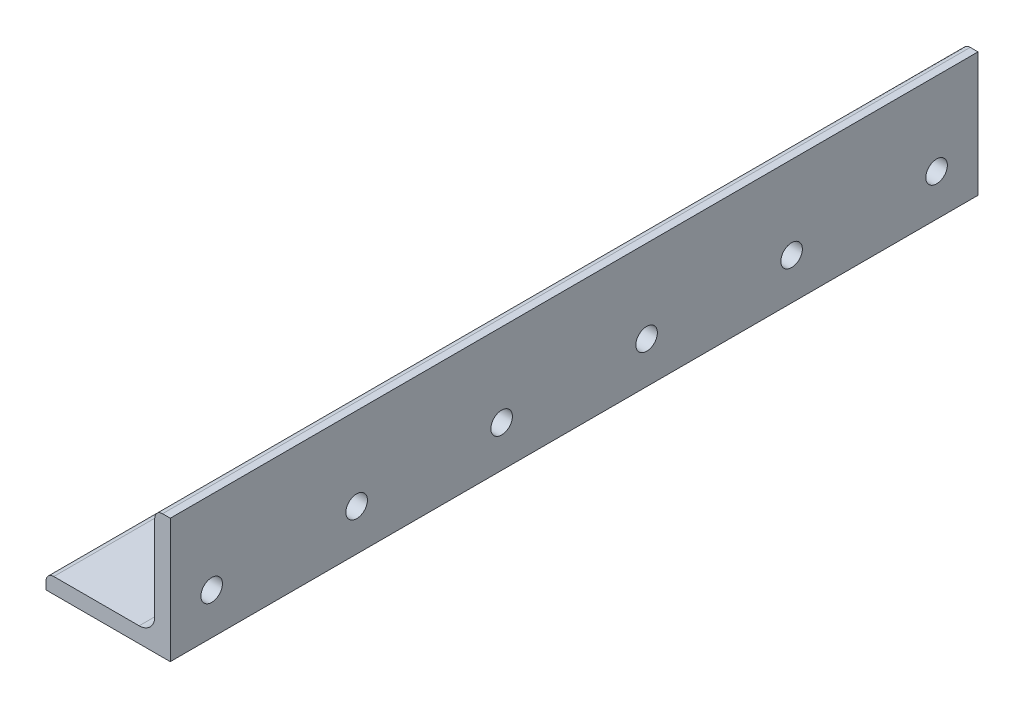
ISO-10303-21;
HEADER;
FILE_DESCRIPTION(('STEP AP214'),'2;1');
FILE_NAME('part.step','',(''),(''),'','','');
FILE_SCHEMA(('AUTOMOTIVE_DESIGN { 1 0 10303 214 1 1 1 1 }'));
ENDSEC;
DATA;
#1=APPLICATION_CONTEXT('core data for automotive mechanical design processes');
#2=APPLICATION_PROTOCOL_DEFINITION('international standard','automotive_design',2000,#1);
#3=PRODUCT_CONTEXT('',#1,'mechanical');
#4=PRODUCT('Part','Part','',(#3));
#5=PRODUCT_RELATED_PRODUCT_CATEGORY('part','',(#4));
#6=PRODUCT_DEFINITION_FORMATION('','',#4);
#7=PRODUCT_DEFINITION_CONTEXT('part definition',#1,'design');
#8=PRODUCT_DEFINITION('design','',#6,#7);
#9=PRODUCT_DEFINITION_SHAPE('','',#8);
#10=(LENGTH_UNIT() NAMED_UNIT(*) SI_UNIT(.MILLI.,.METRE.));
#11=(NAMED_UNIT(*) PLANE_ANGLE_UNIT() SI_UNIT($,.RADIAN.));
#12=(NAMED_UNIT(*) SI_UNIT($,.STERADIAN.) SOLID_ANGLE_UNIT());
#13=UNCERTAINTY_MEASURE_WITH_UNIT(LENGTH_MEASURE(1.E-05),#10,'distance_accuracy_value','');
#14=(GEOMETRIC_REPRESENTATION_CONTEXT(3) GLOBAL_UNCERTAINTY_ASSIGNED_CONTEXT((#13)) GLOBAL_UNIT_ASSIGNED_CONTEXT((#10,
#11,#12)) REPRESENTATION_CONTEXT('',''));
#15=CARTESIAN_POINT('',(0.,0.,0.));
#16=DIRECTION('',(0.,0.,1.));
#17=DIRECTION('',(1.,0.,0.));
#18=AXIS2_PLACEMENT_3D('',#15,#16,#17);
#19=CARTESIAN_POINT('',(-19.05,-16.66875,123.825));
#20=DIRECTION('',(1.,0.,0.));
#21=DIRECTION('',(0.,0.,-1.));
#22=AXIS2_PLACEMENT_3D('',#19,#20,#21);
#23=PLANE('',#22);
#24=DIRECTION('',(0.,-1.,0.));
#25=VECTOR('',#24,1.);
#26=CARTESIAN_POINT('',(-19.05,-16.66875,-123.825));
#27=LINE('',#26,#25);
#28=CARTESIAN_POINT('',(-19.05,-16.66875,-123.825));
#29=VERTEX_POINT('',#28);
#30=CARTESIAN_POINT('',(-19.05,-19.05,-123.825));
#31=VERTEX_POINT('',#30);
#32=EDGE_CURVE('E149',#29,#31,#27,.T.);
#33=ORIENTED_EDGE('',*,*,#32,.T.);
#34=DIRECTION('',(0.,0.,-1.));
#35=VECTOR('',#34,1.);
#36=CARTESIAN_POINT('',(-19.05,-19.05,123.825));
#37=LINE('',#36,#35);
#38=CARTESIAN_POINT('',(-19.05,-19.05,123.825));
#39=VERTEX_POINT('',#38);
#40=EDGE_CURVE('E11',#39,#31,#37,.T.);
#41=ORIENTED_EDGE('',*,*,#40,.F.);
#42=DIRECTION('',(0.,-1.,0.));
#43=VECTOR('',#42,1.);
#44=CARTESIAN_POINT('',(-19.05,-16.66875,123.825));
#45=LINE('',#44,#43);
#46=CARTESIAN_POINT('',(-19.05,-16.66875,123.825));
#47=VERTEX_POINT('',#46);
#48=EDGE_CURVE('E204',#47,#39,#45,.T.);
#49=ORIENTED_EDGE('',*,*,#48,.F.);
#50=DIRECTION('',(0.,0.,-1.));
#51=VECTOR('',#50,1.);
#52=CARTESIAN_POINT('',(-19.05,-16.66875,123.825));
#53=LINE('',#52,#51);
#54=EDGE_CURVE('E205',#47,#29,#53,.T.);
#55=ORIENTED_EDGE('',*,*,#54,.T.);
#56=EDGE_LOOP('',(#33,#41,#49,#55));
#57=FACE_BOUND('',#56,.T.);
#58=ADVANCED_FACE('F33',(#57),#23,.F.);
#59=CARTESIAN_POINT('',(-19.05,-19.05,123.825));
#60=DIRECTION('',(0.,1.,0.));
#61=DIRECTION('',(-1.,0.,0.));
#62=AXIS2_PLACEMENT_3D('',#59,#60,#61);
#63=PLANE('',#62);
#64=CARTESIAN_POINT('',(4.25007251614318E-13,-19.05,-92.075));
#65=DIRECTION('',(0.,-1.,0.));
#66=DIRECTION('',(1.,0.,0.));
#67=AXIS2_PLACEMENT_3D('',#64,#65,#66);
#68=CIRCLE('',#67,3.30199999999999);
#69=CARTESIAN_POINT('',(3.30200000000042,-19.05,-92.075));
#70=VERTEX_POINT('',#69);
#71=EDGE_CURVE('E379',#70,#70,#68,.T.);
#72=ORIENTED_EDGE('',*,*,#71,.F.);
#73=EDGE_LOOP('',(#72));
#74=FACE_BOUND('',#73,.T.);
#75=CARTESIAN_POINT('',(2.68176267385261E-13,-19.05,-46.355));
#76=DIRECTION('',(0.,-1.,0.));
#77=DIRECTION('',(1.,0.,0.));
#78=AXIS2_PLACEMENT_3D('',#75,#76,#77);
#79=CIRCLE('',#78,3.302);
#80=CARTESIAN_POINT('',(3.30200000000027,-19.05,-46.355));
#81=VERTEX_POINT('',#80);
#82=EDGE_CURVE('E373',#81,#81,#79,.T.);
#83=ORIENTED_EDGE('',*,*,#82,.F.);
#84=EDGE_LOOP('',(#83));
#85=FACE_BOUND('',#84,.T.);
#86=CARTESIAN_POINT('',(1.11345283156203E-13,-19.05,-0.634999999999997));
#87=DIRECTION('',(0.,-1.,0.));
#88=DIRECTION('',(1.,0.,0.));
#89=AXIS2_PLACEMENT_3D('',#86,#87,#88);
#90=CIRCLE('',#89,3.302);
#91=CARTESIAN_POINT('',(3.30200000000011,-19.05,-0.634999999999997));
#92=VERTEX_POINT('',#91);
#93=EDGE_CURVE('E367',#92,#92,#90,.T.);
#94=ORIENTED_EDGE('',*,*,#93,.F.);
#95=EDGE_LOOP('',(#94));
#96=FACE_BOUND('',#95,.T.);
#97=CARTESIAN_POINT('',(0.,-19.05,45.085));
#98=DIRECTION('',(0.,-1.,0.));
#99=DIRECTION('',(1.,0.,0.));
#100=AXIS2_PLACEMENT_3D('',#97,#98,#99);
#101=CIRCLE('',#100,3.30199999999999);
#102=CARTESIAN_POINT('',(3.30199999999994,-19.05,45.085));
#103=VERTEX_POINT('',#102);
#104=EDGE_CURVE('E360',#103,#103,#101,.T.);
#105=ORIENTED_EDGE('',*,*,#104,.F.);
#106=EDGE_LOOP('',(#105));
#107=FACE_BOUND('',#106,.T.);
#108=CARTESIAN_POINT('',(-2.02316685301911E-13,-19.05,90.805));
#109=DIRECTION('',(0.,-1.,0.));
#110=DIRECTION('',(1.,0.,0.));
#111=AXIS2_PLACEMENT_3D('',#108,#109,#110);
#112=CIRCLE('',#111,3.30199999999999);
#113=CARTESIAN_POINT('',(3.30199999999979,-19.05,90.805));
#114=VERTEX_POINT('',#113);
#115=EDGE_CURVE('E361',#114,#114,#112,.T.);
#116=ORIENTED_EDGE('',*,*,#115,.F.);
#117=EDGE_LOOP('',(#116));
#118=FACE_BOUND('',#117,.T.);
#119=DIRECTION('',(1.,0.,0.));
#120=VECTOR('',#119,1.);
#121=CARTESIAN_POINT('',(-19.05,-19.05,-123.825));
#122=LINE('',#121,#120);
#123=CARTESIAN_POINT('',(19.05,-19.05,-123.825));
#124=VERTEX_POINT('',#123);
#125=EDGE_CURVE('E186',#31,#124,#122,.T.);
#126=ORIENTED_EDGE('',*,*,#125,.T.);
#127=DIRECTION('',(0.,0.,-1.));
#128=VECTOR('',#127,1.);
#129=CARTESIAN_POINT('',(19.05,-19.05,123.825));
#130=LINE('',#129,#128);
#131=CARTESIAN_POINT('',(19.05,-19.05,123.825));
#132=VERTEX_POINT('',#131);
#133=EDGE_CURVE('E40',#132,#124,#130,.T.);
#134=ORIENTED_EDGE('',*,*,#133,.F.);
#135=DIRECTION('',(1.,0.,0.));
#136=VECTOR('',#135,1.);
#137=CARTESIAN_POINT('',(-19.05,-19.05,123.825));
#138=LINE('',#137,#136);
#139=EDGE_CURVE('E232',#39,#132,#138,.T.);
#140=ORIENTED_EDGE('',*,*,#139,.F.);
#141=ORIENTED_EDGE('',*,*,#40,.T.);
#142=EDGE_LOOP('',(#126,#134,#140,#141));
#143=FACE_BOUND('',#142,.T.);
#144=ADVANCED_FACE('F390',(#74,#85,#96,#107,#118,#143),#63,.F.);
#145=CARTESIAN_POINT('',(19.05,-19.05,123.825));
#146=DIRECTION('',(-1.,0.,0.));
#147=DIRECTION('',(0.,-1.,0.));
#148=AXIS2_PLACEMENT_3D('',#145,#146,#147);
#149=PLANE('',#148);
#150=CARTESIAN_POINT('',(19.05,-6.34999999999978,-111.125));
#151=DIRECTION('',(1.,0.,0.));
#152=DIRECTION('',(0.,1.,0.));
#153=AXIS2_PLACEMENT_3D('',#150,#151,#152);
#154=CIRCLE('',#153,3.302);
#155=CARTESIAN_POINT('',(19.05,-3.04799999999979,-111.125));
#156=VERTEX_POINT('',#155);
#157=EDGE_CURVE('E141',#156,#156,#154,.T.);
#158=ORIENTED_EDGE('',*,*,#157,.F.);
#159=EDGE_LOOP('',(#158));
#160=FACE_BOUND('',#159,.T.);
#161=CARTESIAN_POINT('',(19.05,-6.34999999999978,-66.6750000000001));
#162=DIRECTION('',(1.,0.,0.));
#163=DIRECTION('',(0.,1.,0.));
#164=AXIS2_PLACEMENT_3D('',#161,#162,#163);
#165=CIRCLE('',#164,3.302);
#166=CARTESIAN_POINT('',(19.05,-3.04799999999979,-66.6750000000001));
#167=VERTEX_POINT('',#166);
#168=EDGE_CURVE('E339',#167,#167,#165,.T.);
#169=ORIENTED_EDGE('',*,*,#168,.F.);
#170=EDGE_LOOP('',(#169));
#171=FACE_BOUND('',#170,.T.);
#172=CARTESIAN_POINT('',(19.05,-6.34999999999978,-22.2250000000002));
#173=DIRECTION('',(1.,0.,0.));
#174=DIRECTION('',(0.,1.,0.));
#175=AXIS2_PLACEMENT_3D('',#172,#173,#174);
#176=CIRCLE('',#175,3.302);
#177=CARTESIAN_POINT('',(19.05,-3.04799999999979,-22.2250000000002));
#178=VERTEX_POINT('',#177);
#179=EDGE_CURVE('E329',#178,#178,#176,.T.);
#180=ORIENTED_EDGE('',*,*,#179,.F.);
#181=EDGE_LOOP('',(#180));
#182=FACE_BOUND('',#181,.T.);
#183=CARTESIAN_POINT('',(19.05,-6.34999999999978,22.2249999999999));
#184=DIRECTION('',(1.,0.,0.));
#185=DIRECTION('',(0.,1.,0.));
#186=AXIS2_PLACEMENT_3D('',#183,#184,#185);
#187=CIRCLE('',#186,3.302);
#188=CARTESIAN_POINT('',(19.05,-3.04799999999979,22.2249999999999));
#189=VERTEX_POINT('',#188);
#190=EDGE_CURVE('E294',#189,#189,#187,.T.);
#191=ORIENTED_EDGE('',*,*,#190,.F.);
#192=EDGE_LOOP('',(#191));
#193=FACE_BOUND('',#192,.T.);
#194=CARTESIAN_POINT('',(19.05,-6.34999999999978,66.6749999999999));
#195=DIRECTION('',(1.,0.,0.));
#196=DIRECTION('',(0.,1.,0.));
#197=AXIS2_PLACEMENT_3D('',#194,#195,#196);
#198=CIRCLE('',#197,3.30199999999998);
#199=CARTESIAN_POINT('',(19.05,-3.0479999999998,66.6749999999999));
#200=VERTEX_POINT('',#199);
#201=EDGE_CURVE('E259',#200,#200,#198,.T.);
#202=ORIENTED_EDGE('',*,*,#201,.F.);
#203=EDGE_LOOP('',(#202));
#204=FACE_BOUND('',#203,.T.);
#205=CARTESIAN_POINT('',(19.05,-6.34999999999978,111.125));
#206=DIRECTION('',(1.,0.,0.));
#207=DIRECTION('',(0.,1.,0.));
#208=AXIS2_PLACEMENT_3D('',#205,#206,#207);
#209=CIRCLE('',#208,3.302);
#210=CARTESIAN_POINT('',(19.05,-3.04799999999979,111.125));
#211=VERTEX_POINT('',#210);
#212=EDGE_CURVE('E263',#211,#211,#209,.T.);
#213=ORIENTED_EDGE('',*,*,#212,.F.);
#214=EDGE_LOOP('',(#213));
#215=FACE_BOUND('',#214,.T.);
#216=DIRECTION('',(0.,1.,0.));
#217=VECTOR('',#216,1.);
#218=CARTESIAN_POINT('',(19.05,-19.05,-123.825));
#219=LINE('',#218,#217);
#220=CARTESIAN_POINT('',(19.05,19.05,-123.825));
#221=VERTEX_POINT('',#220);
#222=EDGE_CURVE('E179',#124,#221,#219,.T.);
#223=ORIENTED_EDGE('',*,*,#222,.T.);
#224=DIRECTION('',(0.,0.,-1.));
#225=VECTOR('',#224,1.);
#226=CARTESIAN_POINT('',(19.05,19.05,123.825));
#227=LINE('',#226,#225);
#228=CARTESIAN_POINT('',(19.05,19.05,123.825));
#229=VERTEX_POINT('',#228);
#230=EDGE_CURVE('E170',#229,#221,#227,.T.);
#231=ORIENTED_EDGE('',*,*,#230,.F.);
#232=DIRECTION('',(0.,1.,0.));
#233=VECTOR('',#232,1.);
#234=CARTESIAN_POINT('',(19.05,-19.05,123.825));
#235=LINE('',#234,#233);
#236=EDGE_CURVE('E180',#132,#229,#235,.T.);
#237=ORIENTED_EDGE('',*,*,#236,.F.);
#238=ORIENTED_EDGE('',*,*,#133,.T.);
#239=EDGE_LOOP('',(#223,#231,#237,#238));
#240=FACE_BOUND('',#239,.T.);
#241=ADVANCED_FACE('F177',(#160,#171,#182,#193,#204,#215,#240),#149,.F.);
#242=CARTESIAN_POINT('',(16.66875,19.05,123.825));
#243=DIRECTION('',(0.,-1.,0.));
#244=DIRECTION('',(1.,0.,0.));
#245=AXIS2_PLACEMENT_3D('',#242,#243,#244);
#246=PLANE('',#245);
#247=DIRECTION('',(-1.,0.,0.));
#248=VECTOR('',#247,1.);
#249=CARTESIAN_POINT('',(16.66875,19.05,-123.825));
#250=LINE('',#249,#248);
#251=CARTESIAN_POINT('',(16.66875,19.05,-123.825));
#252=VERTEX_POINT('',#251);
#253=EDGE_CURVE('E188',#221,#252,#250,.T.);
#254=ORIENTED_EDGE('',*,*,#253,.T.);
#255=DIRECTION('',(0.,0.,-1.));
#256=VECTOR('',#255,1.);
#257=CARTESIAN_POINT('',(16.66875,19.05,123.825));
#258=LINE('',#257,#256);
#259=CARTESIAN_POINT('',(16.66875,19.05,123.825));
#260=VERTEX_POINT('',#259);
#261=EDGE_CURVE('E167',#260,#252,#258,.T.);
#262=ORIENTED_EDGE('',*,*,#261,.F.);
#263=DIRECTION('',(-1.,0.,0.));
#264=VECTOR('',#263,1.);
#265=CARTESIAN_POINT('',(16.66875,19.05,123.825));
#266=LINE('',#265,#264);
#267=EDGE_CURVE('E240',#229,#260,#266,.T.);
#268=ORIENTED_EDGE('',*,*,#267,.F.);
#269=ORIENTED_EDGE('',*,*,#230,.T.);
#270=EDGE_LOOP('',(#254,#262,#268,#269));
#271=FACE_BOUND('',#270,.T.);
#272=ADVANCED_FACE('F403',(#271),#246,.F.);
#273=CARTESIAN_POINT('',(16.66875,16.66875,123.825));
#274=DIRECTION('',(0.,0.,-1.));
#275=DIRECTION('',(-1.,0.,0.));
#276=AXIS2_PLACEMENT_3D('',#273,#274,#275);
#277=CYLINDRICAL_SURFACE('',#276,2.38125);
#278=CARTESIAN_POINT('',(16.66875,16.66875,-123.825));
#279=DIRECTION('',(0.,0.,1.));
#280=DIRECTION('',(-1.,0.,0.));
#281=AXIS2_PLACEMENT_3D('',#278,#279,#280);
#282=CIRCLE('',#281,2.38125);
#283=CARTESIAN_POINT('',(14.2875,16.66875,-123.825));
#284=VERTEX_POINT('',#283);
#285=EDGE_CURVE('E190',#252,#284,#282,.T.);
#286=ORIENTED_EDGE('',*,*,#285,.T.);
#287=DIRECTION('',(0.,0.,-1.));
#288=VECTOR('',#287,1.);
#289=CARTESIAN_POINT('',(14.2875,16.66875,123.825));
#290=LINE('',#289,#288);
#291=CARTESIAN_POINT('',(14.2875,16.66875,123.825));
#292=VERTEX_POINT('',#291);
#293=EDGE_CURVE('E162',#292,#284,#290,.T.);
#294=ORIENTED_EDGE('',*,*,#293,.F.);
#295=CARTESIAN_POINT('',(16.66875,16.66875,123.825));
#296=DIRECTION('',(0.,0.,1.));
#297=DIRECTION('',(-1.,0.,0.));
#298=AXIS2_PLACEMENT_3D('',#295,#296,#297);
#299=CIRCLE('',#298,2.38125);
#300=EDGE_CURVE('E242',#260,#292,#299,.T.);
#301=ORIENTED_EDGE('',*,*,#300,.F.);
#302=ORIENTED_EDGE('',*,*,#261,.T.);
#303=EDGE_LOOP('',(#286,#294,#301,#302));
#304=FACE_BOUND('',#303,.T.);
#305=ADVANCED_FACE('F407',(#304),#277,.T.);
#306=CARTESIAN_POINT('',(14.2875,16.66875,123.825));
#307=DIRECTION('',(1.,0.,0.));
#308=DIRECTION('',(0.,1.,0.));
#309=AXIS2_PLACEMENT_3D('',#306,#307,#308);
#310=PLANE('',#309);
#311=DIRECTION('',(0.,0.,-1.));
#312=VECTOR('',#311,1.);
#313=CARTESIAN_POINT('',(14.2875,-9.5123,123.825));
#314=LINE('',#313,#312);
#315=CARTESIAN_POINT('',(14.2875,-9.5123,-112.075296117007));
#316=VERTEX_POINT('',#315);
#317=CARTESIAN_POINT('',(14.2875,-9.5123,-123.825));
#318=VERTEX_POINT('',#317);
#319=EDGE_CURVE('E148',#316,#318,#314,.T.);
#320=ORIENTED_EDGE('',*,*,#319,.F.);
#321=CARTESIAN_POINT('',(14.2875,-6.34999999999978,-111.125));
#322=DIRECTION('',(1.,0.,0.));
#323=DIRECTION('',(0.,1.,0.));
#324=AXIS2_PLACEMENT_3D('',#321,#322,#323);
#325=CIRCLE('',#324,3.302);
#326=CARTESIAN_POINT('',(14.2875,-9.5123,-110.174703882993));
#327=VERTEX_POINT('',#326);
#328=EDGE_CURVE('E46',#327,#316,#325,.F.);
#329=ORIENTED_EDGE('',*,*,#328,.F.);
#330=CARTESIAN_POINT('',(14.2875,-9.5123,-67.6252961170072));
#331=VERTEX_POINT('',#330);
#332=EDGE_CURVE('E146',#331,#327,#314,.T.);
#333=ORIENTED_EDGE('',*,*,#332,.F.);
#334=CARTESIAN_POINT('',(14.2875,-6.34999999999978,-66.6750000000001));
#335=DIRECTION('',(1.,0.,0.));
#336=DIRECTION('',(0.,1.,0.));
#337=AXIS2_PLACEMENT_3D('',#334,#335,#336);
#338=CIRCLE('',#337,3.302);
#339=CARTESIAN_POINT('',(14.2875,-9.5123,-65.7247038829931));
#340=VERTEX_POINT('',#339);
#341=EDGE_CURVE('E53',#340,#331,#338,.F.);
#342=ORIENTED_EDGE('',*,*,#341,.F.);
#343=CARTESIAN_POINT('',(14.2875,-9.5123,-23.1752961170072));
#344=VERTEX_POINT('',#343);
#345=EDGE_CURVE('E154',#344,#340,#314,.T.);
#346=ORIENTED_EDGE('',*,*,#345,.F.);
#347=CARTESIAN_POINT('',(14.2875,-6.34999999999978,-22.2250000000002));
#348=DIRECTION('',(1.,0.,0.));
#349=DIRECTION('',(0.,1.,0.));
#350=AXIS2_PLACEMENT_3D('',#347,#348,#349);
#351=CIRCLE('',#350,3.302);
#352=CARTESIAN_POINT('',(14.2875,-9.5123,-21.2747038829931));
#353=VERTEX_POINT('',#352);
#354=EDGE_CURVE('E305',#353,#344,#351,.F.);
#355=ORIENTED_EDGE('',*,*,#354,.F.);
#356=CARTESIAN_POINT('',(14.2875,-9.5123,21.2747038829929));
#357=VERTEX_POINT('',#356);
#358=EDGE_CURVE('E156',#357,#353,#314,.T.);
#359=ORIENTED_EDGE('',*,*,#358,.F.);
#360=CARTESIAN_POINT('',(14.2875,-6.34999999999978,22.2249999999999));
#361=DIRECTION('',(1.,0.,0.));
#362=DIRECTION('',(0.,1.,0.));
#363=AXIS2_PLACEMENT_3D('',#360,#361,#362);
#364=CIRCLE('',#363,3.302);
#365=CARTESIAN_POINT('',(14.2875,-9.5123,23.1752961170069));
#366=VERTEX_POINT('',#365);
#367=EDGE_CURVE('E302',#366,#357,#364,.F.);
#368=ORIENTED_EDGE('',*,*,#367,.F.);
#369=CARTESIAN_POINT('',(14.2875,-9.5123,65.7247038829929));
#370=VERTEX_POINT('',#369);
#371=EDGE_CURVE('E602',#370,#366,#314,.T.);
#372=ORIENTED_EDGE('',*,*,#371,.F.);
#373=CARTESIAN_POINT('',(14.2875,-6.34999999999978,66.6749999999999));
#374=DIRECTION('',(1.,0.,0.));
#375=DIRECTION('',(0.,1.,0.));
#376=AXIS2_PLACEMENT_3D('',#373,#374,#375);
#377=CIRCLE('',#376,3.30199999999998);
#378=CARTESIAN_POINT('',(14.2875,-9.5123,67.6252961170068));
#379=VERTEX_POINT('',#378);
#380=EDGE_CURVE('E292',#379,#370,#377,.F.);
#381=ORIENTED_EDGE('',*,*,#380,.F.);
#382=CARTESIAN_POINT('',(14.2875,-9.5123,110.174703882993));
#383=VERTEX_POINT('',#382);
#384=EDGE_CURVE('E163',#383,#379,#314,.T.);
#385=ORIENTED_EDGE('',*,*,#384,.F.);
#386=CARTESIAN_POINT('',(14.2875,-6.34999999999978,111.125));
#387=DIRECTION('',(1.,0.,0.));
#388=DIRECTION('',(0.,1.,0.));
#389=AXIS2_PLACEMENT_3D('',#386,#387,#388);
#390=CIRCLE('',#389,3.302);
#391=CARTESIAN_POINT('',(14.2875,-9.5123,112.075296117007));
#392=VERTEX_POINT('',#391);
#393=EDGE_CURVE('E236',#392,#383,#390,.F.);
#394=ORIENTED_EDGE('',*,*,#393,.F.);
#395=CARTESIAN_POINT('',(14.2875,-9.5123,123.825));
#396=VERTEX_POINT('',#395);
#397=EDGE_CURVE('E158',#396,#392,#314,.T.);
#398=ORIENTED_EDGE('',*,*,#397,.F.);
#399=DIRECTION('',(0.,-1.,0.));
#400=VECTOR('',#399,1.);
#401=CARTESIAN_POINT('',(14.2875,16.66875,123.825));
#402=LINE('',#401,#400);
#403=EDGE_CURVE('E244',#292,#396,#402,.T.);
#404=ORIENTED_EDGE('',*,*,#403,.F.);
#405=ORIENTED_EDGE('',*,*,#293,.T.);
#406=DIRECTION('',(0.,-1.,0.));
#407=VECTOR('',#406,1.);
#408=CARTESIAN_POINT('',(14.2875,16.66875,-123.825));
#409=LINE('',#408,#407);
#410=EDGE_CURVE('E196',#284,#318,#409,.T.);
#411=ORIENTED_EDGE('',*,*,#410,.T.);
#412=EDGE_LOOP('',(#320,#329,#333,#342,#346,#355,#359,#368,#372,#381,#385,#394,#398,#404,#405,#411));
#413=FACE_BOUND('',#412,.T.);
#414=ADVANCED_FACE('F145',(#413),#310,.F.);
#415=CARTESIAN_POINT('',(9.51230000000001,-9.5123,123.825));
#416=DIRECTION('',(0.,0.,-1.));
#417=DIRECTION('',(-1.,0.,0.));
#418=AXIS2_PLACEMENT_3D('',#415,#416,#417);
#419=CYLINDRICAL_SURFACE('',#418,4.7752);
#420=ORIENTED_EDGE('',*,*,#332,.T.);
#421=CARTESIAN_POINT('',(14.2875,-9.5123,-112.075296117007));
#422=CARTESIAN_POINT('',(14.2874804342985,-9.53934975240382,-111.985317065942));
#423=CARTESIAN_POINT('',(14.2872693360505,-9.56253932172801,-111.89418108103));
#424=CARTESIAN_POINT('',(14.2867188592411,-9.60107612624237,-111.710252873157));
#425=CARTESIAN_POINT('',(14.2863794630482,-9.61642228286164,-111.617460424224));
#426=CARTESIAN_POINT('',(14.2858339339749,-9.63887065136726,-111.433136543705));
#427=CARTESIAN_POINT('',(14.2856248035142,-9.64616154180989,-111.341628153135));
#428=CARTESIAN_POINT('',(14.2854247125426,-9.65310516943217,-111.158361589149));
#429=CARTESIAN_POINT('',(14.2854336958907,-9.65275987211995,-111.066603486089));
#430=CARTESIAN_POINT('',(14.2857319125072,-9.64248001865079,-110.840710506894));
#431=CARTESIAN_POINT('',(14.2861496985375,-9.62815501837105,-110.706739144487));
#432=CARTESIAN_POINT('',(14.2868077007367,-9.59432734027718,-110.506744214293));
#433=CARTESIAN_POINT('',(14.2870344283897,-9.58081666872214,-110.439643940429));
#434=CARTESIAN_POINT('',(14.2873787588902,-9.54965233736706,-110.306399823443));
#435=CARTESIAN_POINT('',(14.2874963426711,-9.53199795437155,-110.240256149416));
#436=CARTESIAN_POINT('',(14.2875,-9.5123,-110.174703882993));
#437=B_SPLINE_CURVE_WITH_KNOTS('',3,(#421,#422,#423,#424,#425,#426,#427,#428,#429,#430,#431,
#432,#433,#434,#435,#436),.UNSPECIFIED.,.F.,.F.,(4,2,2,2,2,2,2,4),(0.,0.281780339869787,
0.563599417770065,0.838667477255392,1.11366473672535,1.5167167409565,1.72194810666555,
1.92721531775241),.UNSPECIFIED.);
#438=EDGE_CURVE('E136',#316,#327,#437,.T.);
#439=ORIENTED_EDGE('',*,*,#438,.F.);
#440=ORIENTED_EDGE('',*,*,#319,.T.);
#441=CARTESIAN_POINT('',(9.51230000000001,-9.5123,-123.825));
#442=DIRECTION('',(0.,0.,-1.));
#443=DIRECTION('',(-1.,0.,0.));
#444=AXIS2_PLACEMENT_3D('',#441,#442,#443);
#445=CIRCLE('',#444,4.7752);
#446=CARTESIAN_POINT('',(9.51230000000001,-14.2875,-123.825));
#447=VERTEX_POINT('',#446);
#448=EDGE_CURVE('E198',#318,#447,#445,.T.);
#449=ORIENTED_EDGE('',*,*,#448,.T.);
#450=DIRECTION('',(0.,0.,-1.));
#451=VECTOR('',#450,1.);
#452=CARTESIAN_POINT('',(9.51230000000001,-14.2875,123.825));
#453=LINE('',#452,#451);
#454=CARTESIAN_POINT('',(9.51230000000001,-14.2875,123.825));
#455=VERTEX_POINT('',#454);
#456=EDGE_CURVE('E157',#455,#447,#453,.T.);
#457=ORIENTED_EDGE('',*,*,#456,.F.);
#458=CARTESIAN_POINT('',(9.51230000000001,-9.5123,123.825));
#459=DIRECTION('',(0.,0.,-1.));
#460=DIRECTION('',(-1.,0.,0.));
#461=AXIS2_PLACEMENT_3D('',#458,#459,#460);
#462=CIRCLE('',#461,4.7752);
#463=EDGE_CURVE('E246',#396,#455,#462,.T.);
#464=ORIENTED_EDGE('',*,*,#463,.F.);
#465=ORIENTED_EDGE('',*,*,#397,.T.);
#466=CARTESIAN_POINT('',(14.2875,-9.5123,110.174703882993));
#467=CARTESIAN_POINT('',(14.2874804342985,-9.53934975240382,110.264682934058));
#468=CARTESIAN_POINT('',(14.2872693360505,-9.56253932172801,110.35581891897));
#469=CARTESIAN_POINT('',(14.2867188592411,-9.60107612624237,110.539747126843));
#470=CARTESIAN_POINT('',(14.2863794630482,-9.61642228286164,110.632539575776));
#471=CARTESIAN_POINT('',(14.2858339339749,-9.63887065136726,110.816863456295));
#472=CARTESIAN_POINT('',(14.2856248035142,-9.64616154180989,110.908371846865));
#473=CARTESIAN_POINT('',(14.2854247125426,-9.65310516943217,111.091638410851));
#474=CARTESIAN_POINT('',(14.2854336958907,-9.65275987211995,111.183396513911));
#475=CARTESIAN_POINT('',(14.2857319125072,-9.64248001865079,111.409289493106));
#476=CARTESIAN_POINT('',(14.2861496985375,-9.62815501837105,111.543260855513));
#477=CARTESIAN_POINT('',(14.2868077007367,-9.59432734027718,111.743255785707));
#478=CARTESIAN_POINT('',(14.2870344283897,-9.58081666872214,111.810356059571));
#479=CARTESIAN_POINT('',(14.2873787588902,-9.54965233736706,111.943600176557));
#480=CARTESIAN_POINT('',(14.2874963426711,-9.53199795437155,112.009743850584));
#481=CARTESIAN_POINT('',(14.2875,-9.5123,112.075296117007));
#482=B_SPLINE_CURVE_WITH_KNOTS('',3,(#466,#467,#468,#469,#470,#471,#472,#473,#474,#475,#476,
#477,#478,#479,#480,#481),.UNSPECIFIED.,.F.,.F.,(4,2,2,2,2,2,2,4),(0.,0.2817803398698,
0.563599417770064,0.838667477255378,1.11366473672535,1.51671674095652,1.72194810666557,
1.92721531775241),.UNSPECIFIED.);
#483=EDGE_CURVE('E254',#383,#392,#482,.T.);
#484=ORIENTED_EDGE('',*,*,#483,.F.);
#485=ORIENTED_EDGE('',*,*,#384,.T.);
#486=CARTESIAN_POINT('',(14.2875,-9.5123,65.7247038829929));
#487=CARTESIAN_POINT('',(14.2874804342985,-9.53934975240382,65.8146829340583));
#488=CARTESIAN_POINT('',(14.2872693360505,-9.56253932172801,65.9058189189699));
#489=CARTESIAN_POINT('',(14.2867188592411,-9.60107612624236,66.0897471268434));
#490=CARTESIAN_POINT('',(14.2863794630482,-9.61642228286163,66.1825395757759));
#491=CARTESIAN_POINT('',(14.2858339339749,-9.63887065136725,66.3668634562946));
#492=CARTESIAN_POINT('',(14.2856248035142,-9.64616154180987,66.4583718468655));
#493=CARTESIAN_POINT('',(14.2854247125426,-9.65310516943216,66.6416384108507));
#494=CARTESIAN_POINT('',(14.2854336958907,-9.65275987211993,66.7333965139107));
#495=CARTESIAN_POINT('',(14.2857319125072,-9.64248001865077,66.9592894931059));
#496=CARTESIAN_POINT('',(14.2861496985375,-9.62815501837103,67.0932608555135));
#497=CARTESIAN_POINT('',(14.2868077007367,-9.59432734027717,67.293255785707));
#498=CARTESIAN_POINT('',(14.2870344283897,-9.58081666872213,67.360356059571));
#499=CARTESIAN_POINT('',(14.2873787588902,-9.54965233736705,67.4936001765572));
#500=CARTESIAN_POINT('',(14.2874963426711,-9.53199795437155,67.5597438505838));
#501=CARTESIAN_POINT('',(14.2875,-9.5123,67.6252961170068));
#502=B_SPLINE_CURVE_WITH_KNOTS('',3,(#486,#487,#488,#489,#490,#491,#492,#493,#494,#495,#496,
#497,#498,#499,#500,#501),.UNSPECIFIED.,.F.,.F.,(4,2,2,2,2,2,2,4),(0.,0.281780339869786,
0.563599417770062,0.83866747725539,1.11366473672535,1.51671674095644,1.72194810666547,
1.92721531775229),.UNSPECIFIED.);
#503=EDGE_CURVE('E261',#370,#379,#502,.T.);
#504=ORIENTED_EDGE('',*,*,#503,.F.);
#505=ORIENTED_EDGE('',*,*,#371,.T.);
#506=CARTESIAN_POINT('',(14.2875,-9.5123,21.2747038829929));
#507=CARTESIAN_POINT('',(14.2874804342985,-9.53934975240382,21.3646829340582));
#508=CARTESIAN_POINT('',(14.2872693360505,-9.56253932172801,21.4558189189698));
#509=CARTESIAN_POINT('',(14.2867188592411,-9.60107612624237,21.6397471268434));
#510=CARTESIAN_POINT('',(14.2863794630482,-9.61642228286164,21.7325395757758));
#511=CARTESIAN_POINT('',(14.2858339339749,-9.63887065136726,21.9168634562946));
#512=CARTESIAN_POINT('',(14.2856248035142,-9.64616154180989,22.0083718468654));
#513=CARTESIAN_POINT('',(14.2854247125426,-9.65310516943217,22.1916384108506));
#514=CARTESIAN_POINT('',(14.2854336958907,-9.65275987211995,22.2833965139107));
#515=CARTESIAN_POINT('',(14.2857319125072,-9.64248001865079,22.5092894931059));
#516=CARTESIAN_POINT('',(14.2861496985375,-9.62815501837105,22.6432608555135));
#517=CARTESIAN_POINT('',(14.2868077007367,-9.59432734027718,22.843255785707));
#518=CARTESIAN_POINT('',(14.2870344283897,-9.58081666872214,22.9103560595711));
#519=CARTESIAN_POINT('',(14.2873787588902,-9.54965233736706,23.0436001765573));
#520=CARTESIAN_POINT('',(14.2874963426711,-9.53199795437155,23.1097438505838));
#521=CARTESIAN_POINT('',(14.2875,-9.5123,23.1752961170069));
#522=B_SPLINE_CURVE_WITH_KNOTS('',3,(#506,#507,#508,#509,#510,#511,#512,#513,#514,#515,#516,
#517,#518,#519,#520,#521),.UNSPECIFIED.,.F.,.F.,(4,2,2,2,2,2,2,4),(0.,0.28178033986979,
0.563599417770068,0.838667477255385,1.11366473672535,1.51671674095652,1.72194810666557,
1.92721531775241),.UNSPECIFIED.);
#523=EDGE_CURVE('E298',#357,#366,#522,.T.);
#524=ORIENTED_EDGE('',*,*,#523,.F.);
#525=ORIENTED_EDGE('',*,*,#358,.T.);
#526=CARTESIAN_POINT('',(14.2875,-9.5123,-23.1752961170072));
#527=CARTESIAN_POINT('',(14.2874804342985,-9.53934975240382,-23.0853170659418));
#528=CARTESIAN_POINT('',(14.2872693360505,-9.56253932172801,-22.9941810810302));
#529=CARTESIAN_POINT('',(14.2867188592411,-9.60107612624237,-22.8102528731566));
#530=CARTESIAN_POINT('',(14.2863794630482,-9.61642228286164,-22.7174604242242));
#531=CARTESIAN_POINT('',(14.2858339339749,-9.63887065136726,-22.5331365437055));
#532=CARTESIAN_POINT('',(14.2856248035142,-9.64616154180989,-22.4416281531346));
#533=CARTESIAN_POINT('',(14.2854247125426,-9.65310516943217,-22.2583615891494));
#534=CARTESIAN_POINT('',(14.2854336958907,-9.65275987211995,-22.1666034860894));
#535=CARTESIAN_POINT('',(14.2857319125072,-9.64248001865079,-21.9407105068942));
#536=CARTESIAN_POINT('',(14.2861496985375,-9.62815501837105,-21.8067391444866));
#537=CARTESIAN_POINT('',(14.2868077007367,-9.59432734027718,-21.606744214293));
#538=CARTESIAN_POINT('',(14.2870344283897,-9.58081666872214,-21.539643940429));
#539=CARTESIAN_POINT('',(14.2873787588902,-9.54965233736706,-21.4063998234428));
#540=CARTESIAN_POINT('',(14.2874963426711,-9.53199795437155,-21.3402561494162));
#541=CARTESIAN_POINT('',(14.2875,-9.51230000000001,-21.2747038829931));
#542=B_SPLINE_CURVE_WITH_KNOTS('',3,(#526,#527,#528,#529,#530,#531,#532,#533,#534,#535,#536,
#537,#538,#539,#540,#541),.UNSPECIFIED.,.F.,.F.,(4,2,2,2,2,2,2,4),(0.,0.281780339869793,
0.563599417770067,0.838667477255385,1.11366473672535,1.51671674095651,1.72194810666557,
1.92721531775241),.UNSPECIFIED.);
#543=EDGE_CURVE('E323',#344,#353,#542,.T.);
#544=ORIENTED_EDGE('',*,*,#543,.F.);
#545=ORIENTED_EDGE('',*,*,#345,.T.);
#546=CARTESIAN_POINT('',(14.2875,-9.5123,-67.6252961170071));
#547=CARTESIAN_POINT('',(14.2874804342985,-9.53934975240382,-67.5353170659418));
#548=CARTESIAN_POINT('',(14.2872693360505,-9.56253932172801,-67.4441810810302));
#549=CARTESIAN_POINT('',(14.2867188592411,-9.60107612624237,-67.2602528731566));
#550=CARTESIAN_POINT('',(14.2863794630482,-9.61642228286164,-67.1674604242242));
#551=CARTESIAN_POINT('',(14.2858339339749,-9.63887065136726,-66.9831365437054));
#552=CARTESIAN_POINT('',(14.2856248035142,-9.64616154180989,-66.8916281531346));
#553=CARTESIAN_POINT('',(14.2854247125426,-9.65310516943217,-66.7083615891494));
#554=CARTESIAN_POINT('',(14.2854336958907,-9.65275987211995,-66.6166034860893));
#555=CARTESIAN_POINT('',(14.2857319125072,-9.64248001865079,-66.3907105068941));
#556=CARTESIAN_POINT('',(14.2861496985375,-9.62815501837105,-66.2567391444865));
#557=CARTESIAN_POINT('',(14.2868077007367,-9.59432734027718,-66.056744214293));
#558=CARTESIAN_POINT('',(14.2870344283897,-9.58081666872214,-65.9896439404289));
#559=CARTESIAN_POINT('',(14.2873787588902,-9.54965233736706,-65.8563998234427));
#560=CARTESIAN_POINT('',(14.2874963426711,-9.53199795437155,-65.7902561494162));
#561=CARTESIAN_POINT('',(14.2875,-9.5123,-65.7247038829931));
#562=B_SPLINE_CURVE_WITH_KNOTS('',3,(#546,#547,#548,#549,#550,#551,#552,#553,#554,#555,#556,
#557,#558,#559,#560,#561),.UNSPECIFIED.,.F.,.F.,(4,2,2,2,2,2,2,4),(0.,0.281780339869787,
0.563599417770065,0.838667477255392,1.11366473672535,1.5167167409565,1.72194810666555,
1.92721531775241),.UNSPECIFIED.);
#563=EDGE_CURVE('E153',#331,#340,#562,.T.);
#564=ORIENTED_EDGE('',*,*,#563,.F.);
#565=EDGE_LOOP('',(#420,#439,#440,#449,#457,#464,#465,#484,#485,#504,#505,#524,#525,#544,#545,#564));
#566=FACE_BOUND('',#565,.T.);
#567=ADVANCED_FACE('F151',(#566),#419,.F.);
#568=CARTESIAN_POINT('',(9.51230000000001,-14.2875,123.825));
#569=DIRECTION('',(0.,-1.,0.));
#570=DIRECTION('',(0.,0.,-1.));
#571=AXIS2_PLACEMENT_3D('',#568,#569,#570);
#572=PLANE('',#571);
#573=CARTESIAN_POINT('',(4.24573570745324E-13,-14.2875,-92.075));
#574=DIRECTION('',(0.,-1.,0.));
#575=DIRECTION('',(0.,0.,-1.));
#576=AXIS2_PLACEMENT_3D('',#573,#574,#575);
#577=CIRCLE('',#576,3.30199999999999);
#578=CARTESIAN_POINT('',(4.24573570745324E-13,-14.2875,-95.377));
#579=VERTEX_POINT('',#578);
#580=EDGE_CURVE('E265',#579,#579,#577,.F.);
#581=ORIENTED_EDGE('',*,*,#580,.F.);
#582=EDGE_LOOP('',(#581));
#583=FACE_BOUND('',#582,.T.);
#584=CARTESIAN_POINT('',(2.67742586516266E-13,-14.2875,-46.355));
#585=DIRECTION('',(0.,-1.,0.));
#586=DIRECTION('',(0.,0.,-1.));
#587=AXIS2_PLACEMENT_3D('',#584,#585,#586);
#588=CIRCLE('',#587,3.302);
#589=CARTESIAN_POINT('',(2.67742586516266E-13,-14.2875,-49.657));
#590=VERTEX_POINT('',#589);
#591=EDGE_CURVE('E376',#590,#590,#588,.F.);
#592=ORIENTED_EDGE('',*,*,#591,.F.);
#593=EDGE_LOOP('',(#592));
#594=FACE_BOUND('',#593,.T.);
#595=CARTESIAN_POINT('',(1.10911602287209E-13,-14.2875,-0.634999999999997));
#596=DIRECTION('',(0.,-1.,0.));
#597=DIRECTION('',(0.,0.,-1.));
#598=AXIS2_PLACEMENT_3D('',#595,#596,#597);
#599=CIRCLE('',#598,3.302);
#600=CARTESIAN_POINT('',(1.10911602287209E-13,-14.2875,-3.937));
#601=VERTEX_POINT('',#600);
#602=EDGE_CURVE('E370',#601,#601,#599,.F.);
#603=ORIENTED_EDGE('',*,*,#602,.F.);
#604=EDGE_LOOP('',(#603));
#605=FACE_BOUND('',#604,.T.);
#606=CARTESIAN_POINT('',(0.,-14.2875,45.085));
#607=DIRECTION('',(0.,-1.,0.));
#608=DIRECTION('',(0.,0.,-1.));
#609=AXIS2_PLACEMENT_3D('',#606,#607,#608);
#610=CIRCLE('',#609,3.30199999999999);
#611=CARTESIAN_POINT('',(0.,-14.2875,41.783));
#612=VERTEX_POINT('',#611);
#613=EDGE_CURVE('E364',#612,#612,#610,.F.);
#614=ORIENTED_EDGE('',*,*,#613,.F.);
#615=EDGE_LOOP('',(#614));
#616=FACE_BOUND('',#615,.T.);
#617=CARTESIAN_POINT('',(-2.02750366170905E-13,-14.2875,90.805));
#618=DIRECTION('',(0.,-1.,0.));
#619=DIRECTION('',(0.,0.,-1.));
#620=AXIS2_PLACEMENT_3D('',#617,#618,#619);
#621=CIRCLE('',#620,3.30199999999999);
#622=CARTESIAN_POINT('',(-2.02750366170905E-13,-14.2875,87.503));
#623=VERTEX_POINT('',#622);
#624=EDGE_CURVE('E357',#623,#623,#621,.F.);
#625=ORIENTED_EDGE('',*,*,#624,.F.);
#626=EDGE_LOOP('',(#625));
#627=FACE_BOUND('',#626,.T.);
#628=DIRECTION('',(-1.,0.,0.));
#629=VECTOR('',#628,1.);
#630=CARTESIAN_POINT('',(9.51230000000001,-14.2875,-123.825));
#631=LINE('',#630,#629);
#632=CARTESIAN_POINT('',(-16.66875,-14.2875,-123.825));
#633=VERTEX_POINT('',#632);
#634=EDGE_CURVE('E200',#447,#633,#631,.T.);
#635=ORIENTED_EDGE('',*,*,#634,.T.);
#636=DIRECTION('',(0.,0.,-1.));
#637=VECTOR('',#636,1.);
#638=CARTESIAN_POINT('',(-16.66875,-14.2875,123.825));
#639=LINE('',#638,#637);
#640=CARTESIAN_POINT('',(-16.66875,-14.2875,123.825));
#641=VERTEX_POINT('',#640);
#642=EDGE_CURVE('E207',#641,#633,#639,.T.);
#643=ORIENTED_EDGE('',*,*,#642,.F.);
#644=DIRECTION('',(-1.,0.,0.));
#645=VECTOR('',#644,1.);
#646=CARTESIAN_POINT('',(9.51230000000001,-14.2875,123.825));
#647=LINE('',#646,#645);
#648=EDGE_CURVE('E220',#455,#641,#647,.T.);
#649=ORIENTED_EDGE('',*,*,#648,.F.);
#650=ORIENTED_EDGE('',*,*,#456,.T.);
#651=EDGE_LOOP('',(#635,#643,#649,#650));
#652=FACE_BOUND('',#651,.T.);
#653=ADVANCED_FACE('F219',(#583,#594,#605,#616,#627,#652),#572,.F.);
#654=CARTESIAN_POINT('',(-16.66875,-16.66875,123.825));
#655=DIRECTION('',(0.,0.,-1.));
#656=DIRECTION('',(-1.,0.,0.));
#657=AXIS2_PLACEMENT_3D('',#654,#655,#656);
#658=CYLINDRICAL_SURFACE('',#657,2.38125);
#659=CARTESIAN_POINT('',(-16.66875,-16.66875,-123.825));
#660=DIRECTION('',(0.,0.,1.));
#661=DIRECTION('',(-1.,0.,0.));
#662=AXIS2_PLACEMENT_3D('',#659,#660,#661);
#663=CIRCLE('',#662,2.38125);
#664=EDGE_CURVE('E202',#633,#29,#663,.T.);
#665=ORIENTED_EDGE('',*,*,#664,.T.);
#666=ORIENTED_EDGE('',*,*,#54,.F.);
#667=CARTESIAN_POINT('',(-16.66875,-16.66875,123.825));
#668=DIRECTION('',(0.,0.,1.));
#669=DIRECTION('',(-1.,0.,0.));
#670=AXIS2_PLACEMENT_3D('',#667,#668,#669);
#671=CIRCLE('',#670,2.38125);
#672=EDGE_CURVE('E208',#641,#47,#671,.T.);
#673=ORIENTED_EDGE('',*,*,#672,.F.);
#674=ORIENTED_EDGE('',*,*,#642,.T.);
#675=EDGE_LOOP('',(#665,#666,#673,#674));
#676=FACE_BOUND('',#675,.T.);
#677=ADVANCED_FACE('F226',(#676),#658,.T.);
#678=CARTESIAN_POINT('',(16.66875,16.66875,123.825));
#679=DIRECTION('',(0.,0.,-1.));
#680=DIRECTION('',(-1.,0.,0.));
#681=AXIS2_PLACEMENT_3D('',#678,#679,#680);
#682=PLANE('',#681);
#683=ORIENTED_EDGE('',*,*,#48,.T.);
#684=ORIENTED_EDGE('',*,*,#139,.T.);
#685=ORIENTED_EDGE('',*,*,#236,.T.);
#686=ORIENTED_EDGE('',*,*,#267,.T.);
#687=ORIENTED_EDGE('',*,*,#300,.T.);
#688=ORIENTED_EDGE('',*,*,#403,.T.);
#689=ORIENTED_EDGE('',*,*,#463,.T.);
#690=ORIENTED_EDGE('',*,*,#648,.T.);
#691=ORIENTED_EDGE('',*,*,#672,.T.);
#692=EDGE_LOOP('',(#683,#684,#685,#686,#687,#688,#689,#690,#691));
#693=FACE_BOUND('',#692,.T.);
#694=ADVANCED_FACE('F249',(#693),#682,.F.);
#695=CARTESIAN_POINT('',(16.66875,16.66875,-123.825));
#696=DIRECTION('',(0.,0.,-1.));
#697=DIRECTION('',(-1.,0.,0.));
#698=AXIS2_PLACEMENT_3D('',#695,#696,#697);
#699=PLANE('',#698);
#700=ORIENTED_EDGE('',*,*,#32,.F.);
#701=ORIENTED_EDGE('',*,*,#664,.F.);
#702=ORIENTED_EDGE('',*,*,#634,.F.);
#703=ORIENTED_EDGE('',*,*,#448,.F.);
#704=ORIENTED_EDGE('',*,*,#410,.F.);
#705=ORIENTED_EDGE('',*,*,#285,.F.);
#706=ORIENTED_EDGE('',*,*,#253,.F.);
#707=ORIENTED_EDGE('',*,*,#222,.F.);
#708=ORIENTED_EDGE('',*,*,#125,.F.);
#709=EDGE_LOOP('',(#700,#701,#702,#703,#704,#705,#706,#707,#708));
#710=FACE_BOUND('',#709,.T.);
#711=ADVANCED_FACE('F185',(#710),#699,.T.);
#712=CARTESIAN_POINT('',(-19.051,-6.34999999999979,111.125));
#713=DIRECTION('',(1.,0.,0.));
#714=DIRECTION('',(0.,1.,0.));
#715=AXIS2_PLACEMENT_3D('',#712,#713,#714);
#716=CYLINDRICAL_SURFACE('',#715,3.302);
#717=ORIENTED_EDGE('',*,*,#212,.T.);
#718=EDGE_LOOP('',(#717));
#719=FACE_BOUND('',#718,.T.);
#720=ORIENTED_EDGE('',*,*,#393,.T.);
#721=ORIENTED_EDGE('',*,*,#483,.T.);
#722=EDGE_LOOP('',(#720,#721));
#723=FACE_BOUND('',#722,.T.);
#724=ADVANCED_FACE('F274',(#719,#723),#716,.F.);
#725=CARTESIAN_POINT('',(-19.051,-6.34999999999979,66.6749999999999));
#726=DIRECTION('',(1.,0.,0.));
#727=DIRECTION('',(0.,1.,0.));
#728=AXIS2_PLACEMENT_3D('',#725,#726,#727);
#729=CYLINDRICAL_SURFACE('',#728,3.30199999999998);
#730=ORIENTED_EDGE('',*,*,#201,.T.);
#731=EDGE_LOOP('',(#730));
#732=FACE_BOUND('',#731,.T.);
#733=ORIENTED_EDGE('',*,*,#380,.T.);
#734=ORIENTED_EDGE('',*,*,#503,.T.);
#735=EDGE_LOOP('',(#733,#734));
#736=FACE_BOUND('',#735,.T.);
#737=ADVANCED_FACE('F279',(#732,#736),#729,.F.);
#738=CARTESIAN_POINT('',(-19.051,-6.34999999999979,22.2249999999999));
#739=DIRECTION('',(1.,0.,0.));
#740=DIRECTION('',(0.,1.,0.));
#741=AXIS2_PLACEMENT_3D('',#738,#739,#740);
#742=CYLINDRICAL_SURFACE('',#741,3.302);
#743=ORIENTED_EDGE('',*,*,#190,.T.);
#744=EDGE_LOOP('',(#743));
#745=FACE_BOUND('',#744,.T.);
#746=ORIENTED_EDGE('',*,*,#367,.T.);
#747=ORIENTED_EDGE('',*,*,#523,.T.);
#748=EDGE_LOOP('',(#746,#747));
#749=FACE_BOUND('',#748,.T.);
#750=ADVANCED_FACE('F283',(#745,#749),#742,.F.);
#751=CARTESIAN_POINT('',(-19.051,-6.34999999999979,-22.2250000000002));
#752=DIRECTION('',(1.,0.,0.));
#753=DIRECTION('',(0.,1.,0.));
#754=AXIS2_PLACEMENT_3D('',#751,#752,#753);
#755=CYLINDRICAL_SURFACE('',#754,3.302);
#756=ORIENTED_EDGE('',*,*,#179,.T.);
#757=EDGE_LOOP('',(#756));
#758=FACE_BOUND('',#757,.T.);
#759=ORIENTED_EDGE('',*,*,#354,.T.);
#760=ORIENTED_EDGE('',*,*,#543,.T.);
#761=EDGE_LOOP('',(#759,#760));
#762=FACE_BOUND('',#761,.T.);
#763=ADVANCED_FACE('F315',(#758,#762),#755,.F.);
#764=CARTESIAN_POINT('',(-19.051,-6.34999999999979,-66.6750000000001));
#765=DIRECTION('',(1.,0.,0.));
#766=DIRECTION('',(0.,1.,0.));
#767=AXIS2_PLACEMENT_3D('',#764,#765,#766);
#768=CYLINDRICAL_SURFACE('',#767,3.302);
#769=ORIENTED_EDGE('',*,*,#168,.T.);
#770=EDGE_LOOP('',(#769));
#771=FACE_BOUND('',#770,.T.);
#772=ORIENTED_EDGE('',*,*,#341,.T.);
#773=ORIENTED_EDGE('',*,*,#563,.T.);
#774=EDGE_LOOP('',(#772,#773));
#775=FACE_BOUND('',#774,.T.);
#776=ADVANCED_FACE('F319',(#771,#775),#768,.F.);
#777=CARTESIAN_POINT('',(-19.051,-6.34999999999979,-111.125));
#778=DIRECTION('',(1.,0.,0.));
#779=DIRECTION('',(0.,1.,0.));
#780=AXIS2_PLACEMENT_3D('',#777,#778,#779);
#781=CYLINDRICAL_SURFACE('',#780,3.302);
#782=ORIENTED_EDGE('',*,*,#157,.T.);
#783=EDGE_LOOP('',(#782));
#784=FACE_BOUND('',#783,.T.);
#785=ORIENTED_EDGE('',*,*,#328,.T.);
#786=ORIENTED_EDGE('',*,*,#438,.T.);
#787=EDGE_LOOP('',(#785,#786));
#788=FACE_BOUND('',#787,.T.);
#789=ADVANCED_FACE('F137',(#784,#788),#781,.F.);
#790=CARTESIAN_POINT('',(-2.05786223315464E-13,19.051,90.805));
#791=DIRECTION('',(0.,-1.,0.));
#792=DIRECTION('',(1.,0.,0.));
#793=AXIS2_PLACEMENT_3D('',#790,#791,#792);
#794=CYLINDRICAL_SURFACE('',#793,3.30199999999999);
#795=ORIENTED_EDGE('',*,*,#115,.T.);
#796=EDGE_LOOP('',(#795));
#797=FACE_BOUND('',#796,.T.);
#798=ORIENTED_EDGE('',*,*,#624,.T.);
#799=EDGE_LOOP('',(#798));
#800=FACE_BOUND('',#799,.T.);
#801=ADVANCED_FACE('F346',(#797,#800),#794,.F.);
#802=CARTESIAN_POINT('',(0.,19.051,45.085));
#803=DIRECTION('',(0.,-1.,0.));
#804=DIRECTION('',(1.,0.,0.));
#805=AXIS2_PLACEMENT_3D('',#802,#803,#804);
#806=CYLINDRICAL_SURFACE('',#805,3.30199999999999);
#807=ORIENTED_EDGE('',*,*,#104,.T.);
#808=EDGE_LOOP('',(#807));
#809=FACE_BOUND('',#808,.T.);
#810=ORIENTED_EDGE('',*,*,#613,.T.);
#811=EDGE_LOOP('',(#810));
#812=FACE_BOUND('',#811,.T.);
#813=ADVANCED_FACE('F506',(#809,#812),#806,.F.);
#814=CARTESIAN_POINT('',(1.0787574514265E-13,19.051,-0.634999999999997));
#815=DIRECTION('',(0.,-1.,0.));
#816=DIRECTION('',(1.,0.,0.));
#817=AXIS2_PLACEMENT_3D('',#814,#815,#816);
#818=CYLINDRICAL_SURFACE('',#817,3.302);
#819=ORIENTED_EDGE('',*,*,#93,.T.);
#820=EDGE_LOOP('',(#819));
#821=FACE_BOUND('',#820,.T.);
#822=ORIENTED_EDGE('',*,*,#602,.T.);
#823=EDGE_LOOP('',(#822));
#824=FACE_BOUND('',#823,.T.);
#825=ADVANCED_FACE('F513',(#821,#824),#818,.F.);
#826=CARTESIAN_POINT('',(2.64706729371707E-13,19.051,-46.355));
#827=DIRECTION('',(0.,-1.,0.));
#828=DIRECTION('',(1.,0.,0.));
#829=AXIS2_PLACEMENT_3D('',#826,#827,#828);
#830=CYLINDRICAL_SURFACE('',#829,3.302);
#831=ORIENTED_EDGE('',*,*,#82,.T.);
#832=EDGE_LOOP('',(#831));
#833=FACE_BOUND('',#832,.T.);
#834=ORIENTED_EDGE('',*,*,#591,.T.);
#835=EDGE_LOOP('',(#834));
#836=FACE_BOUND('',#835,.T.);
#837=ADVANCED_FACE('F521',(#833,#836),#830,.F.);
#838=CARTESIAN_POINT('',(4.21537713600764E-13,19.051,-92.075));
#839=DIRECTION('',(0.,-1.,0.));
#840=DIRECTION('',(1.,0.,0.));
#841=AXIS2_PLACEMENT_3D('',#838,#839,#840);
#842=CYLINDRICAL_SURFACE('',#841,3.30199999999999);
#843=ORIENTED_EDGE('',*,*,#71,.T.);
#844=EDGE_LOOP('',(#843));
#845=FACE_BOUND('',#844,.T.);
#846=ORIENTED_EDGE('',*,*,#580,.T.);
#847=EDGE_LOOP('',(#846));
#848=FACE_BOUND('',#847,.T.);
#849=ADVANCED_FACE('F387',(#845,#848),#842,.F.);
#850=CLOSED_SHELL('',(#58,#144,#241,#272,#305,#414,#567,#653,#677,#694,#711,#724,#737,#750,#763,
#776,#789,#801,#813,#825,#837,#849));
#851=MANIFOLD_SOLID_BREP('B2',#850);
#852=ADVANCED_BREP_SHAPE_REPRESENTATION('',(#18,#851),#14);
#853=SHAPE_DEFINITION_REPRESENTATION(#9,#852);
ENDSEC;
END-ISO-10303-21;
